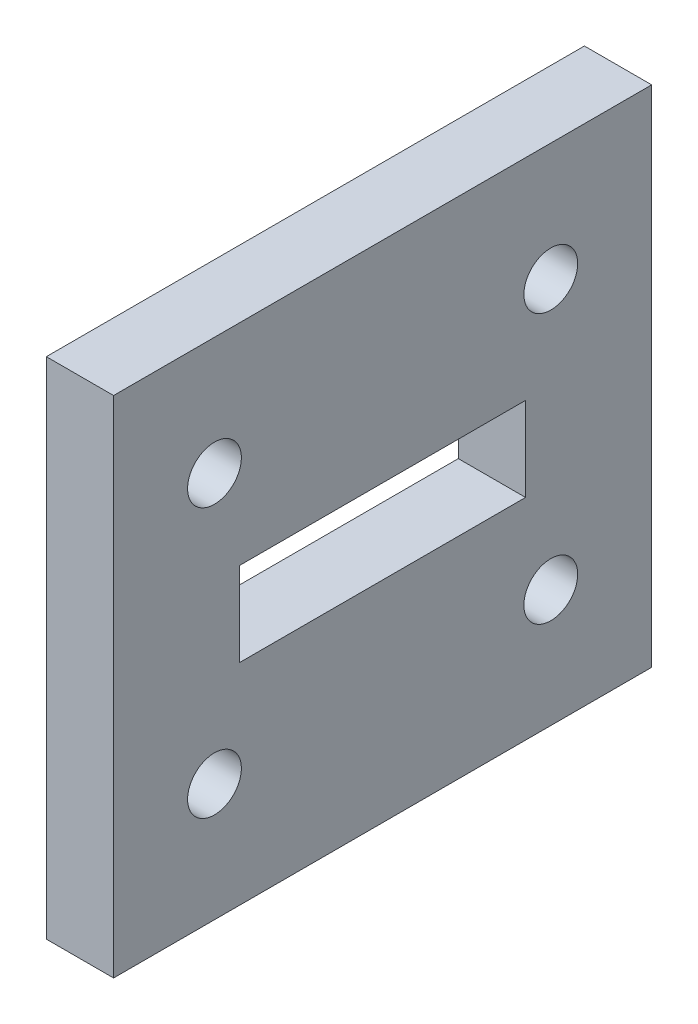
ISO-10303-21;
HEADER;
FILE_DESCRIPTION(('STEP AP214'),'2;1');
FILE_NAME('part.step','',(''),(''),'','','');
FILE_SCHEMA(('AUTOMOTIVE_DESIGN { 1 0 10303 214 1 1 1 1 }'));
ENDSEC;
DATA;
#1=APPLICATION_CONTEXT('core data for automotive mechanical design processes');
#2=APPLICATION_PROTOCOL_DEFINITION('international standard','automotive_design',2000,#1);
#3=PRODUCT_CONTEXT('',#1,'mechanical');
#4=PRODUCT('Part','Part','',(#3));
#5=PRODUCT_RELATED_PRODUCT_CATEGORY('part','',(#4));
#6=PRODUCT_DEFINITION_FORMATION('','',#4);
#7=PRODUCT_DEFINITION_CONTEXT('part definition',#1,'design');
#8=PRODUCT_DEFINITION('design','',#6,#7);
#9=PRODUCT_DEFINITION_SHAPE('','',#8);
#10=(LENGTH_UNIT() NAMED_UNIT(*) SI_UNIT(.MILLI.,.METRE.));
#11=(NAMED_UNIT(*) PLANE_ANGLE_UNIT() SI_UNIT($,.RADIAN.));
#12=(NAMED_UNIT(*) SI_UNIT($,.STERADIAN.) SOLID_ANGLE_UNIT());
#13=UNCERTAINTY_MEASURE_WITH_UNIT(LENGTH_MEASURE(1.E-05),#10,'distance_accuracy_value','');
#14=(GEOMETRIC_REPRESENTATION_CONTEXT(3) GLOBAL_UNCERTAINTY_ASSIGNED_CONTEXT((#13)) GLOBAL_UNIT_ASSIGNED_CONTEXT((#10,
#11,#12)) REPRESENTATION_CONTEXT('',''));
#15=CARTESIAN_POINT('',(0.,0.,0.));
#16=DIRECTION('',(0.,0.,1.));
#17=DIRECTION('',(1.,0.,0.));
#18=AXIS2_PLACEMENT_3D('',#15,#16,#17);
#19=CARTESIAN_POINT('',(19.4739237782046,0.,0.));
#20=DIRECTION('',(1.,0.,0.));
#21=DIRECTION('',(0.,1.,0.));
#22=AXIS2_PLACEMENT_3D('',#19,#20,#21);
#23=PLANE('',#22);
#24=DIRECTION('',(0.,0.,-1.));
#25=VECTOR('',#24,1.);
#26=CARTESIAN_POINT('',(19.4739237782046,25.9936178572667,-11.2636966730218));
#27=LINE('',#26,#25);
#28=CARTESIAN_POINT('',(19.4739237782046,25.9936178572667,5.73630332697818));
#29=VERTEX_POINT('',#28);
#30=CARTESIAN_POINT('',(19.4739237782046,25.9936178572667,-11.2636966730218));
#31=VERTEX_POINT('',#30);
#32=EDGE_CURVE('E102',#29,#31,#27,.T.);
#33=ORIENTED_EDGE('',*,*,#32,.T.);
#34=DIRECTION('',(0.,-1.,0.));
#35=VECTOR('',#34,1.);
#36=CARTESIAN_POINT('',(19.4739237782046,25.9936178572667,-11.2636966730218));
#37=LINE('',#36,#35);
#38=CARTESIAN_POINT('',(19.4739237782046,20.9936178572667,-11.2636966730218));
#39=VERTEX_POINT('',#38);
#40=EDGE_CURVE('E111',#31,#39,#37,.T.);
#41=ORIENTED_EDGE('',*,*,#40,.T.);
#42=DIRECTION('',(0.,0.,1.));
#43=VECTOR('',#42,1.);
#44=CARTESIAN_POINT('',(19.4739237782046,20.9936178572667,-11.2636966730218));
#45=LINE('',#44,#43);
#46=CARTESIAN_POINT('',(19.4739237782046,20.9936178572667,5.73630332697818));
#47=VERTEX_POINT('',#46);
#48=EDGE_CURVE('E50',#39,#47,#45,.T.);
#49=ORIENTED_EDGE('',*,*,#48,.T.);
#50=DIRECTION('',(0.,1.,0.));
#51=VECTOR('',#50,1.);
#52=CARTESIAN_POINT('',(19.4739237782046,25.9936178572667,5.73630332697818));
#53=LINE('',#52,#51);
#54=EDGE_CURVE('E108',#47,#29,#53,.T.);
#55=ORIENTED_EDGE('',*,*,#54,.T.);
#56=EDGE_LOOP('',(#33,#41,#49,#55));
#57=FACE_BOUND('',#56,.T.);
#58=CARTESIAN_POINT('',(19.4739237782046,15.4936178572667,7.23630332697818));
#59=DIRECTION('',(1.,0.,0.));
#60=DIRECTION('',(0.,0.,-1.));
#61=AXIS2_PLACEMENT_3D('',#58,#59,#60);
#62=CIRCLE('',#61,1.6);
#63=CARTESIAN_POINT('',(19.4739237782046,15.4936178572667,5.63630332697818));
#64=VERTEX_POINT('',#63);
#65=EDGE_CURVE('E142',#64,#64,#62,.T.);
#66=ORIENTED_EDGE('',*,*,#65,.F.);
#67=EDGE_LOOP('',(#66));
#68=FACE_BOUND('',#67,.T.);
#69=CARTESIAN_POINT('',(19.4739237782046,31.4936178572667,7.23630332697817));
#70=DIRECTION('',(1.,0.,0.));
#71=DIRECTION('',(0.,0.,-1.));
#72=AXIS2_PLACEMENT_3D('',#69,#70,#71);
#73=CIRCLE('',#72,1.6);
#74=CARTESIAN_POINT('',(19.4739237782046,31.4936178572667,5.63630332697818));
#75=VERTEX_POINT('',#74);
#76=EDGE_CURVE('E154',#75,#75,#73,.T.);
#77=ORIENTED_EDGE('',*,*,#76,.F.);
#78=EDGE_LOOP('',(#77));
#79=FACE_BOUND('',#78,.T.);
#80=DIRECTION('',(0.,0.,1.));
#81=VECTOR('',#80,1.);
#82=CARTESIAN_POINT('',(19.4739237782046,38.4936178572667,-18.7636966730218));
#83=LINE('',#82,#81);
#84=CARTESIAN_POINT('',(19.4739237782046,38.4936178572667,-18.7636966730218));
#85=VERTEX_POINT('',#84);
#86=CARTESIAN_POINT('',(19.4739237782046,38.4936178572667,13.2363033269782));
#87=VERTEX_POINT('',#86);
#88=EDGE_CURVE('E160',#85,#87,#83,.T.);
#89=ORIENTED_EDGE('',*,*,#88,.T.);
#90=DIRECTION('',(0.,-1.,0.));
#91=VECTOR('',#90,1.);
#92=CARTESIAN_POINT('',(19.4739237782046,38.4936178572667,13.2363033269782));
#93=LINE('',#92,#91);
#94=CARTESIAN_POINT('',(19.4739237782046,8.49361785726671,13.2363033269782));
#95=VERTEX_POINT('',#94);
#96=EDGE_CURVE('E163',#87,#95,#93,.T.);
#97=ORIENTED_EDGE('',*,*,#96,.T.);
#98=DIRECTION('',(0.,0.,-1.));
#99=VECTOR('',#98,1.);
#100=CARTESIAN_POINT('',(19.4739237782046,8.49361785726671,13.2363033269782));
#101=LINE('',#100,#99);
#102=CARTESIAN_POINT('',(19.4739237782046,8.49361785726672,-18.7636966730218));
#103=VERTEX_POINT('',#102);
#104=EDGE_CURVE('E166',#95,#103,#101,.T.);
#105=ORIENTED_EDGE('',*,*,#104,.T.);
#106=DIRECTION('',(0.,1.,0.));
#107=VECTOR('',#106,1.);
#108=CARTESIAN_POINT('',(19.4739237782046,8.49361785726672,-18.7636966730218));
#109=LINE('',#108,#107);
#110=EDGE_CURVE('E168',#103,#85,#109,.T.);
#111=ORIENTED_EDGE('',*,*,#110,.T.);
#112=EDGE_LOOP('',(#89,#97,#105,#111));
#113=FACE_BOUND('',#112,.T.);
#114=CARTESIAN_POINT('',(19.4739237782046,31.4936178572667,-12.7636966730218));
#115=DIRECTION('',(1.,0.,0.));
#116=DIRECTION('',(0.,0.,-1.));
#117=AXIS2_PLACEMENT_3D('',#114,#115,#116);
#118=CIRCLE('',#117,1.6);
#119=CARTESIAN_POINT('',(19.4739237782046,31.4936178572667,-14.3636966730218));
#120=VERTEX_POINT('',#119);
#121=EDGE_CURVE('E148',#120,#120,#118,.T.);
#122=ORIENTED_EDGE('',*,*,#121,.F.);
#123=EDGE_LOOP('',(#122));
#124=FACE_BOUND('',#123,.T.);
#125=CARTESIAN_POINT('',(19.4739237782046,15.4936178572667,-12.7636966730218));
#126=DIRECTION('',(1.,0.,0.));
#127=DIRECTION('',(0.,0.,-1.));
#128=AXIS2_PLACEMENT_3D('',#125,#126,#127);
#129=CIRCLE('',#128,1.6);
#130=CARTESIAN_POINT('',(19.4739237782046,15.4936178572667,-14.3636966730218));
#131=VERTEX_POINT('',#130);
#132=EDGE_CURVE('E136',#131,#131,#129,.T.);
#133=ORIENTED_EDGE('',*,*,#132,.F.);
#134=EDGE_LOOP('',(#133));
#135=FACE_BOUND('',#134,.T.);
#136=ADVANCED_FACE('F35',(#57,#68,#79,#113,#124,#135),#23,.T.);
#137=CARTESIAN_POINT('',(15.4739237782046,0.,0.));
#138=DIRECTION('',(1.,0.,0.));
#139=DIRECTION('',(0.,1.,0.));
#140=AXIS2_PLACEMENT_3D('',#137,#138,#139);
#141=PLANE('',#140);
#142=DIRECTION('',(0.,-1.,0.));
#143=VECTOR('',#142,1.);
#144=CARTESIAN_POINT('',(15.4739237782046,25.9936178572667,-11.2636966730218));
#145=LINE('',#144,#143);
#146=CARTESIAN_POINT('',(15.4739237782046,25.9936178572667,-11.2636966730218));
#147=VERTEX_POINT('',#146);
#148=CARTESIAN_POINT('',(15.4739237782046,20.9936178572667,-11.2636966730218));
#149=VERTEX_POINT('',#148);
#150=EDGE_CURVE('E126',#147,#149,#145,.T.);
#151=ORIENTED_EDGE('',*,*,#150,.F.);
#152=DIRECTION('',(0.,0.,-1.));
#153=VECTOR('',#152,1.);
#154=CARTESIAN_POINT('',(15.4739237782046,25.9936178572667,-11.2636966730218));
#155=LINE('',#154,#153);
#156=CARTESIAN_POINT('',(15.4739237782046,25.9936178572667,5.73630332697818));
#157=VERTEX_POINT('',#156);
#158=EDGE_CURVE('E58',#157,#147,#155,.T.);
#159=ORIENTED_EDGE('',*,*,#158,.F.);
#160=DIRECTION('',(0.,1.,0.));
#161=VECTOR('',#160,1.);
#162=CARTESIAN_POINT('',(15.4739237782046,25.9936178572667,5.73630332697818));
#163=LINE('',#162,#161);
#164=CARTESIAN_POINT('',(15.4739237782046,20.9936178572667,5.73630332697818));
#165=VERTEX_POINT('',#164);
#166=EDGE_CURVE('E117',#165,#157,#163,.T.);
#167=ORIENTED_EDGE('',*,*,#166,.F.);
#168=DIRECTION('',(0.,0.,1.));
#169=VECTOR('',#168,1.);
#170=CARTESIAN_POINT('',(15.4739237782046,20.9936178572667,-11.2636966730218));
#171=LINE('',#170,#169);
#172=EDGE_CURVE('E120',#149,#165,#171,.T.);
#173=ORIENTED_EDGE('',*,*,#172,.F.);
#174=EDGE_LOOP('',(#151,#159,#167,#173));
#175=FACE_BOUND('',#174,.T.);
#176=DIRECTION('',(0.,0.,1.));
#177=VECTOR('',#176,1.);
#178=CARTESIAN_POINT('',(15.4739237782046,38.4936178572667,-18.7636966730218));
#179=LINE('',#178,#177);
#180=CARTESIAN_POINT('',(15.4739237782046,38.4936178572667,-18.7636966730218));
#181=VERTEX_POINT('',#180);
#182=CARTESIAN_POINT('',(15.4739237782046,38.4936178572667,13.2363033269782));
#183=VERTEX_POINT('',#182);
#184=EDGE_CURVE('E157',#181,#183,#179,.T.);
#185=ORIENTED_EDGE('',*,*,#184,.F.);
#186=DIRECTION('',(0.,1.,0.));
#187=VECTOR('',#186,1.);
#188=CARTESIAN_POINT('',(15.4739237782046,8.49361785726672,-18.7636966730218));
#189=LINE('',#188,#187);
#190=CARTESIAN_POINT('',(15.4739237782046,8.49361785726672,-18.7636966730218));
#191=VERTEX_POINT('',#190);
#192=EDGE_CURVE('E164',#191,#181,#189,.T.);
#193=ORIENTED_EDGE('',*,*,#192,.F.);
#194=DIRECTION('',(0.,0.,-1.));
#195=VECTOR('',#194,1.);
#196=CARTESIAN_POINT('',(15.4739237782046,8.49361785726671,13.2363033269782));
#197=LINE('',#196,#195);
#198=CARTESIAN_POINT('',(15.4739237782046,8.49361785726671,13.2363033269782));
#199=VERTEX_POINT('',#198);
#200=EDGE_CURVE('E175',#199,#191,#197,.T.);
#201=ORIENTED_EDGE('',*,*,#200,.F.);
#202=DIRECTION('',(0.,-1.,0.));
#203=VECTOR('',#202,1.);
#204=CARTESIAN_POINT('',(15.4739237782046,38.4936178572667,13.2363033269782));
#205=LINE('',#204,#203);
#206=EDGE_CURVE('E173',#183,#199,#205,.T.);
#207=ORIENTED_EDGE('',*,*,#206,.F.);
#208=EDGE_LOOP('',(#185,#193,#201,#207));
#209=FACE_BOUND('',#208,.T.);
#210=CARTESIAN_POINT('',(15.4739237782046,31.4936178572667,7.23630332697817));
#211=DIRECTION('',(1.,0.,0.));
#212=DIRECTION('',(0.,0.,-1.));
#213=AXIS2_PLACEMENT_3D('',#210,#211,#212);
#214=CIRCLE('',#213,1.6);
#215=CARTESIAN_POINT('',(15.4739237782046,31.4936178572667,5.63630332697818));
#216=VERTEX_POINT('',#215);
#217=EDGE_CURVE('E151',#216,#216,#214,.T.);
#218=ORIENTED_EDGE('',*,*,#217,.T.);
#219=EDGE_LOOP('',(#218));
#220=FACE_BOUND('',#219,.T.);
#221=CARTESIAN_POINT('',(15.4739237782046,31.4936178572667,-12.7636966730218));
#222=DIRECTION('',(1.,0.,0.));
#223=DIRECTION('',(0.,0.,-1.));
#224=AXIS2_PLACEMENT_3D('',#221,#222,#223);
#225=CIRCLE('',#224,1.6);
#226=CARTESIAN_POINT('',(15.4739237782046,31.4936178572667,-14.3636966730218));
#227=VERTEX_POINT('',#226);
#228=EDGE_CURVE('E145',#227,#227,#225,.T.);
#229=ORIENTED_EDGE('',*,*,#228,.T.);
#230=EDGE_LOOP('',(#229));
#231=FACE_BOUND('',#230,.T.);
#232=CARTESIAN_POINT('',(15.4739237782046,15.4936178572667,7.23630332697818));
#233=DIRECTION('',(1.,0.,0.));
#234=DIRECTION('',(0.,0.,-1.));
#235=AXIS2_PLACEMENT_3D('',#232,#233,#234);
#236=CIRCLE('',#235,1.6);
#237=CARTESIAN_POINT('',(15.4739237782046,15.4936178572667,5.63630332697818));
#238=VERTEX_POINT('',#237);
#239=EDGE_CURVE('E139',#238,#238,#236,.T.);
#240=ORIENTED_EDGE('',*,*,#239,.T.);
#241=EDGE_LOOP('',(#240));
#242=FACE_BOUND('',#241,.T.);
#243=CARTESIAN_POINT('',(15.4739237782046,15.4936178572667,-12.7636966730218));
#244=DIRECTION('',(1.,0.,0.));
#245=DIRECTION('',(0.,0.,-1.));
#246=AXIS2_PLACEMENT_3D('',#243,#244,#245);
#247=CIRCLE('',#246,1.6);
#248=CARTESIAN_POINT('',(15.4739237782046,15.4936178572667,-14.3636966730218));
#249=VERTEX_POINT('',#248);
#250=EDGE_CURVE('E132',#249,#249,#247,.T.);
#251=ORIENTED_EDGE('',*,*,#250,.T.);
#252=EDGE_LOOP('',(#251));
#253=FACE_BOUND('',#252,.T.);
#254=ADVANCED_FACE('F193',(#175,#209,#220,#231,#242,#253),#141,.F.);
#255=CARTESIAN_POINT('',(19.4739237782046,38.4936178572667,-18.7636966730218));
#256=DIRECTION('',(0.,-1.,0.));
#257=DIRECTION('',(1.,0.,0.));
#258=AXIS2_PLACEMENT_3D('',#255,#256,#257);
#259=PLANE('',#258);
#260=ORIENTED_EDGE('',*,*,#184,.T.);
#261=DIRECTION('',(-1.,0.,0.));
#262=VECTOR('',#261,1.);
#263=CARTESIAN_POINT('',(19.4739237782046,38.4936178572667,13.2363033269782));
#264=LINE('',#263,#262);
#265=EDGE_CURVE('E11',#87,#183,#264,.T.);
#266=ORIENTED_EDGE('',*,*,#265,.F.);
#267=ORIENTED_EDGE('',*,*,#88,.F.);
#268=DIRECTION('',(-1.,0.,0.));
#269=VECTOR('',#268,1.);
#270=CARTESIAN_POINT('',(19.4739237782046,38.4936178572667,-18.7636966730218));
#271=LINE('',#270,#269);
#272=EDGE_CURVE('E170',#85,#181,#271,.T.);
#273=ORIENTED_EDGE('',*,*,#272,.T.);
#274=EDGE_LOOP('',(#260,#266,#267,#273));
#275=FACE_BOUND('',#274,.T.);
#276=ADVANCED_FACE('F37',(#275),#259,.F.);
#277=CARTESIAN_POINT('',(19.4739237782046,38.4936178572667,13.2363033269782));
#278=DIRECTION('',(0.,0.,-1.));
#279=DIRECTION('',(-1.,0.,0.));
#280=AXIS2_PLACEMENT_3D('',#277,#278,#279);
#281=PLANE('',#280);
#282=ORIENTED_EDGE('',*,*,#206,.T.);
#283=DIRECTION('',(-1.,0.,0.));
#284=VECTOR('',#283,1.);
#285=CARTESIAN_POINT('',(19.4739237782046,8.49361785726671,13.2363033269782));
#286=LINE('',#285,#284);
#287=EDGE_CURVE('E43',#95,#199,#286,.T.);
#288=ORIENTED_EDGE('',*,*,#287,.F.);
#289=ORIENTED_EDGE('',*,*,#96,.F.);
#290=ORIENTED_EDGE('',*,*,#265,.T.);
#291=EDGE_LOOP('',(#282,#288,#289,#290));
#292=FACE_BOUND('',#291,.T.);
#293=ADVANCED_FACE('F204',(#292),#281,.F.);
#294=CARTESIAN_POINT('',(19.4739237782046,8.49361785726671,13.2363033269782));
#295=DIRECTION('',(0.,1.,0.));
#296=DIRECTION('',(-1.,0.,0.));
#297=AXIS2_PLACEMENT_3D('',#294,#295,#296);
#298=PLANE('',#297);
#299=ORIENTED_EDGE('',*,*,#200,.T.);
#300=DIRECTION('',(-1.,0.,0.));
#301=VECTOR('',#300,1.);
#302=CARTESIAN_POINT('',(19.4739237782046,8.49361785726672,-18.7636966730218));
#303=LINE('',#302,#301);
#304=EDGE_CURVE('E180',#103,#191,#303,.T.);
#305=ORIENTED_EDGE('',*,*,#304,.F.);
#306=ORIENTED_EDGE('',*,*,#104,.F.);
#307=ORIENTED_EDGE('',*,*,#287,.T.);
#308=EDGE_LOOP('',(#299,#305,#306,#307));
#309=FACE_BOUND('',#308,.T.);
#310=ADVANCED_FACE('F187',(#309),#298,.F.);
#311=CARTESIAN_POINT('',(19.4739237782046,8.49361785726672,-18.7636966730218));
#312=DIRECTION('',(0.,0.,1.));
#313=DIRECTION('',(1.,0.,0.));
#314=AXIS2_PLACEMENT_3D('',#311,#312,#313);
#315=PLANE('',#314);
#316=ORIENTED_EDGE('',*,*,#192,.T.);
#317=ORIENTED_EDGE('',*,*,#272,.F.);
#318=ORIENTED_EDGE('',*,*,#110,.F.);
#319=ORIENTED_EDGE('',*,*,#304,.T.);
#320=EDGE_LOOP('',(#316,#317,#318,#319));
#321=FACE_BOUND('',#320,.T.);
#322=ADVANCED_FACE('F197',(#321),#315,.F.);
#323=CARTESIAN_POINT('',(19.4739237782046,31.4936178572667,7.23630332697817));
#324=DIRECTION('',(-1.,0.,0.));
#325=DIRECTION('',(0.,0.,1.));
#326=AXIS2_PLACEMENT_3D('',#323,#324,#325);
#327=CYLINDRICAL_SURFACE('',#326,1.6);
#328=ORIENTED_EDGE('',*,*,#76,.T.);
#329=EDGE_LOOP('',(#328));
#330=FACE_BOUND('',#329,.T.);
#331=ORIENTED_EDGE('',*,*,#217,.F.);
#332=EDGE_LOOP('',(#331));
#333=FACE_BOUND('',#332,.T.);
#334=ADVANCED_FACE('F219',(#330,#333),#327,.F.);
#335=CARTESIAN_POINT('',(19.4739237782046,31.4936178572667,-12.7636966730218));
#336=DIRECTION('',(-1.,0.,0.));
#337=DIRECTION('',(0.,0.,1.));
#338=AXIS2_PLACEMENT_3D('',#335,#336,#337);
#339=CYLINDRICAL_SURFACE('',#338,1.6);
#340=ORIENTED_EDGE('',*,*,#121,.T.);
#341=EDGE_LOOP('',(#340));
#342=FACE_BOUND('',#341,.T.);
#343=ORIENTED_EDGE('',*,*,#228,.F.);
#344=EDGE_LOOP('',(#343));
#345=FACE_BOUND('',#344,.T.);
#346=ADVANCED_FACE('F226',(#342,#345),#339,.F.);
#347=CARTESIAN_POINT('',(19.4739237782046,15.4936178572667,7.23630332697818));
#348=DIRECTION('',(-1.,0.,0.));
#349=DIRECTION('',(0.,0.,1.));
#350=AXIS2_PLACEMENT_3D('',#347,#348,#349);
#351=CYLINDRICAL_SURFACE('',#350,1.6);
#352=ORIENTED_EDGE('',*,*,#65,.T.);
#353=EDGE_LOOP('',(#352));
#354=FACE_BOUND('',#353,.T.);
#355=ORIENTED_EDGE('',*,*,#239,.F.);
#356=EDGE_LOOP('',(#355));
#357=FACE_BOUND('',#356,.T.);
#358=ADVANCED_FACE('F231',(#354,#357),#351,.F.);
#359=CARTESIAN_POINT('',(19.4739237782046,15.4936178572667,-12.7636966730218));
#360=DIRECTION('',(-1.,0.,0.));
#361=DIRECTION('',(0.,0.,1.));
#362=AXIS2_PLACEMENT_3D('',#359,#360,#361);
#363=CYLINDRICAL_SURFACE('',#362,1.6);
#364=ORIENTED_EDGE('',*,*,#132,.T.);
#365=EDGE_LOOP('',(#364));
#366=FACE_BOUND('',#365,.T.);
#367=ORIENTED_EDGE('',*,*,#250,.F.);
#368=EDGE_LOOP('',(#367));
#369=FACE_BOUND('',#368,.T.);
#370=ADVANCED_FACE('F243',(#366,#369),#363,.F.);
#371=CARTESIAN_POINT('',(19.4739237782046,25.9936178572667,-11.2636966730218));
#372=DIRECTION('',(0.,1.,0.));
#373=DIRECTION('',(0.,0.,1.));
#374=AXIS2_PLACEMENT_3D('',#371,#372,#373);
#375=PLANE('',#374);
#376=ORIENTED_EDGE('',*,*,#158,.T.);
#377=DIRECTION('',(-1.,0.,0.));
#378=VECTOR('',#377,1.);
#379=CARTESIAN_POINT('',(19.4739237782046,25.9936178572667,-11.2636966730218));
#380=LINE('',#379,#378);
#381=EDGE_CURVE('E98',#31,#147,#380,.T.);
#382=ORIENTED_EDGE('',*,*,#381,.F.);
#383=ORIENTED_EDGE('',*,*,#32,.F.);
#384=DIRECTION('',(-1.,0.,0.));
#385=VECTOR('',#384,1.);
#386=CARTESIAN_POINT('',(19.4739237782046,25.9936178572667,5.73630332697818));
#387=LINE('',#386,#385);
#388=EDGE_CURVE('E130',#29,#157,#387,.T.);
#389=ORIENTED_EDGE('',*,*,#388,.T.);
#390=EDGE_LOOP('',(#376,#382,#383,#389));
#391=FACE_BOUND('',#390,.T.);
#392=ADVANCED_FACE('F100',(#391),#375,.F.);
#393=CARTESIAN_POINT('',(19.4739237782046,25.9936178572667,5.73630332697818));
#394=DIRECTION('',(0.,0.,1.));
#395=DIRECTION('',(0.,-1.,0.));
#396=AXIS2_PLACEMENT_3D('',#393,#394,#395);
#397=PLANE('',#396);
#398=ORIENTED_EDGE('',*,*,#166,.T.);
#399=ORIENTED_EDGE('',*,*,#388,.F.);
#400=ORIENTED_EDGE('',*,*,#54,.F.);
#401=DIRECTION('',(-1.,0.,0.));
#402=VECTOR('',#401,1.);
#403=CARTESIAN_POINT('',(19.4739237782046,20.9936178572667,5.73630332697818));
#404=LINE('',#403,#402);
#405=EDGE_CURVE('E133',#47,#165,#404,.T.);
#406=ORIENTED_EDGE('',*,*,#405,.T.);
#407=EDGE_LOOP('',(#398,#399,#400,#406));
#408=FACE_BOUND('',#407,.T.);
#409=ADVANCED_FACE('F251',(#408),#397,.F.);
#410=CARTESIAN_POINT('',(19.4739237782046,20.9936178572667,-11.2636966730218));
#411=DIRECTION('',(0.,-1.,0.));
#412=DIRECTION('',(1.,0.,0.));
#413=AXIS2_PLACEMENT_3D('',#410,#411,#412);
#414=PLANE('',#413);
#415=ORIENTED_EDGE('',*,*,#172,.T.);
#416=ORIENTED_EDGE('',*,*,#405,.F.);
#417=ORIENTED_EDGE('',*,*,#48,.F.);
#418=DIRECTION('',(-1.,0.,0.));
#419=VECTOR('',#418,1.);
#420=CARTESIAN_POINT('',(19.4739237782046,20.9936178572667,-11.2636966730218));
#421=LINE('',#420,#419);
#422=EDGE_CURVE('E107',#39,#149,#421,.T.);
#423=ORIENTED_EDGE('',*,*,#422,.T.);
#424=EDGE_LOOP('',(#415,#416,#417,#423));
#425=FACE_BOUND('',#424,.T.);
#426=ADVANCED_FACE('F258',(#425),#414,.F.);
#427=CARTESIAN_POINT('',(19.4739237782046,25.9936178572667,-11.2636966730218));
#428=DIRECTION('',(0.,0.,-1.));
#429=DIRECTION('',(-1.,0.,0.));
#430=AXIS2_PLACEMENT_3D('',#427,#428,#429);
#431=PLANE('',#430);
#432=ORIENTED_EDGE('',*,*,#150,.T.);
#433=ORIENTED_EDGE('',*,*,#422,.F.);
#434=ORIENTED_EDGE('',*,*,#40,.F.);
#435=ORIENTED_EDGE('',*,*,#381,.T.);
#436=EDGE_LOOP('',(#432,#433,#434,#435));
#437=FACE_BOUND('',#436,.T.);
#438=ADVANCED_FACE('F112',(#437),#431,.F.);
#439=CLOSED_SHELL('',(#136,#254,#276,#293,#310,#322,#334,#346,#358,#370,#392,#409,#426,#438));
#440=MANIFOLD_SOLID_BREP('B2',#439);
#441=ADVANCED_BREP_SHAPE_REPRESENTATION('',(#18,#440),#14);
#442=SHAPE_DEFINITION_REPRESENTATION(#9,#441);
ENDSEC;
END-ISO-10303-21;
